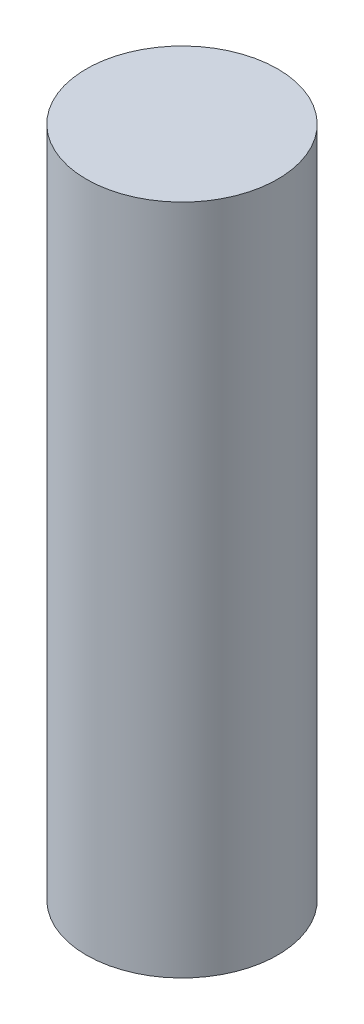
ISO-10303-21;
HEADER;
FILE_DESCRIPTION(('STEP AP214'),'2;1');
FILE_NAME('part.step','',(''),(''),'','','');
FILE_SCHEMA(('AUTOMOTIVE_DESIGN { 1 0 10303 214 1 1 1 1 }'));
ENDSEC;
DATA;
#1=APPLICATION_CONTEXT('core data for automotive mechanical design processes');
#2=APPLICATION_PROTOCOL_DEFINITION('international standard','automotive_design',2000,#1);
#3=PRODUCT_CONTEXT('',#1,'mechanical');
#4=PRODUCT('Part','Part','',(#3));
#5=PRODUCT_RELATED_PRODUCT_CATEGORY('part','',(#4));
#6=PRODUCT_DEFINITION_FORMATION('','',#4);
#7=PRODUCT_DEFINITION_CONTEXT('part definition',#1,'design');
#8=PRODUCT_DEFINITION('design','',#6,#7);
#9=PRODUCT_DEFINITION_SHAPE('','',#8);
#10=(LENGTH_UNIT() NAMED_UNIT(*) SI_UNIT(.MILLI.,.METRE.));
#11=(NAMED_UNIT(*) PLANE_ANGLE_UNIT() SI_UNIT($,.RADIAN.));
#12=(NAMED_UNIT(*) SI_UNIT($,.STERADIAN.) SOLID_ANGLE_UNIT());
#13=UNCERTAINTY_MEASURE_WITH_UNIT(LENGTH_MEASURE(1.E-05),#10,'distance_accuracy_value','');
#14=(GEOMETRIC_REPRESENTATION_CONTEXT(3) GLOBAL_UNCERTAINTY_ASSIGNED_CONTEXT((#13)) GLOBAL_UNIT_ASSIGNED_CONTEXT((#10,
#11,#12)) REPRESENTATION_CONTEXT('',''));
#15=CARTESIAN_POINT('',(0.,0.,0.));
#16=DIRECTION('',(0.,0.,1.));
#17=DIRECTION('',(1.,0.,0.));
#18=AXIS2_PLACEMENT_3D('',#15,#16,#17);
#19=CARTESIAN_POINT('',(0.,65.,0.));
#20=DIRECTION('',(0.,-1.,0.));
#21=DIRECTION('',(0.,0.,-1.));
#22=AXIS2_PLACEMENT_3D('',#19,#20,#21);
#23=CYLINDRICAL_SURFACE('',#22,9.25);
#24=CARTESIAN_POINT('',(0.,65.,0.));
#25=DIRECTION('',(0.,1.,0.));
#26=DIRECTION('',(0.,0.,1.));
#27=AXIS2_PLACEMENT_3D('',#24,#25,#26);
#28=CIRCLE('',#27,9.25);
#29=CARTESIAN_POINT('',(0.,65.,9.25));
#30=VERTEX_POINT('',#29);
#31=EDGE_CURVE('E10',#30,#30,#28,.T.);
#32=ORIENTED_EDGE('',*,*,#31,.F.);
#33=EDGE_LOOP('',(#32));
#34=FACE_BOUND('',#33,.T.);
#35=CARTESIAN_POINT('',(0.,0.,0.));
#36=DIRECTION('',(0.,1.,0.));
#37=DIRECTION('',(0.,0.,1.));
#38=AXIS2_PLACEMENT_3D('',#35,#36,#37);
#39=CIRCLE('',#38,9.25);
#40=CARTESIAN_POINT('',(0.,0.,9.25));
#41=VERTEX_POINT('',#40);
#42=EDGE_CURVE('E39',#41,#41,#39,.T.);
#43=ORIENTED_EDGE('',*,*,#42,.T.);
#44=EDGE_LOOP('',(#43));
#45=FACE_BOUND('',#44,.T.);
#46=ADVANCED_FACE('F36',(#34,#45),#23,.T.);
#47=CARTESIAN_POINT('',(0.,65.,0.));
#48=DIRECTION('',(0.,1.,0.));
#49=DIRECTION('',(0.,0.,1.));
#50=AXIS2_PLACEMENT_3D('',#47,#48,#49);
#51=PLANE('',#50);
#52=ORIENTED_EDGE('',*,*,#31,.T.);
#53=EDGE_LOOP('',(#52));
#54=FACE_BOUND('',#53,.T.);
#55=ADVANCED_FACE('F51',(#54),#51,.T.);
#56=CARTESIAN_POINT('',(0.,0.,0.));
#57=DIRECTION('',(0.,1.,0.));
#58=DIRECTION('',(0.,0.,1.));
#59=AXIS2_PLACEMENT_3D('',#56,#57,#58);
#60=PLANE('',#59);
#61=ORIENTED_EDGE('',*,*,#42,.F.);
#62=EDGE_LOOP('',(#61));
#63=FACE_BOUND('',#62,.T.);
#64=ADVANCED_FACE('F49',(#63),#60,.F.);
#65=CLOSED_SHELL('',(#46,#55,#64));
#66=MANIFOLD_SOLID_BREP('B2',#65);
#67=ADVANCED_BREP_SHAPE_REPRESENTATION('',(#18,#66),#14);
#68=SHAPE_DEFINITION_REPRESENTATION(#9,#67);
ENDSEC;
END-ISO-10303-21;
